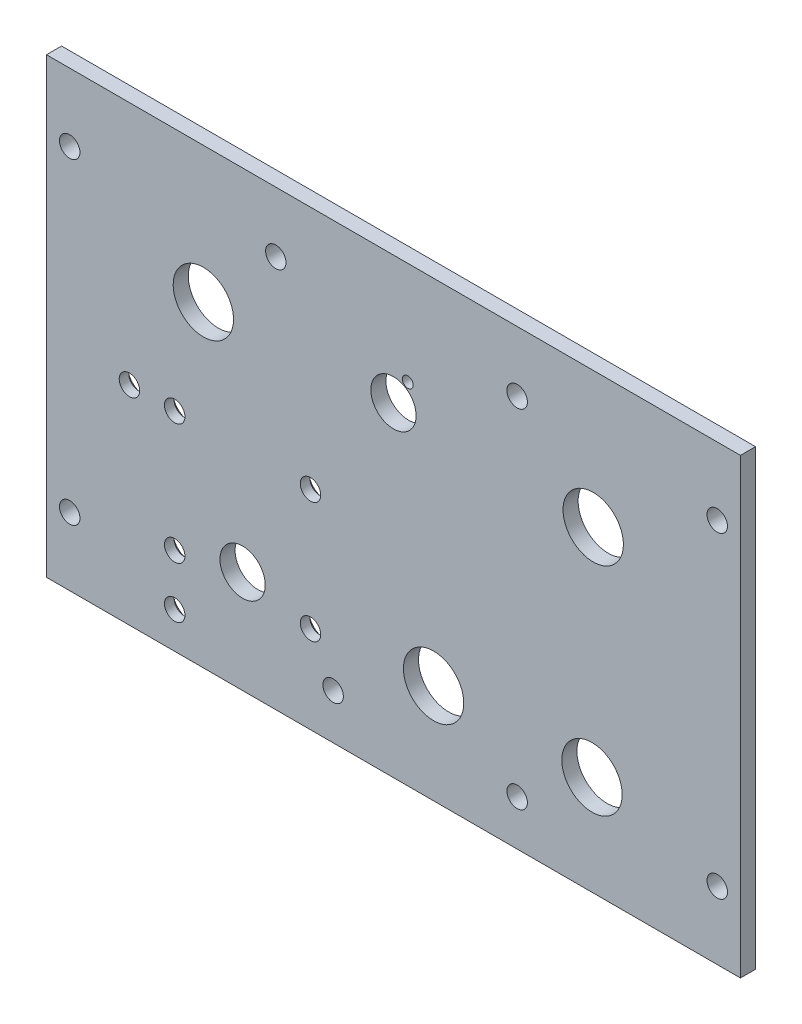
ISO-10303-21;
HEADER;
FILE_DESCRIPTION(('STEP AP214'),'2;1');
FILE_NAME('part.step','',(''),(''),'','','');
FILE_SCHEMA(('AUTOMOTIVE_DESIGN { 1 0 10303 214 1 1 1 1 }'));
ENDSEC;
DATA;
#1=APPLICATION_CONTEXT('core data for automotive mechanical design processes');
#2=APPLICATION_PROTOCOL_DEFINITION('international standard','automotive_design',2000,#1);
#3=PRODUCT_CONTEXT('',#1,'mechanical');
#4=PRODUCT('Part','Part','',(#3));
#5=PRODUCT_RELATED_PRODUCT_CATEGORY('part','',(#4));
#6=PRODUCT_DEFINITION_FORMATION('','',#4);
#7=PRODUCT_DEFINITION_CONTEXT('part definition',#1,'design');
#8=PRODUCT_DEFINITION('design','',#6,#7);
#9=PRODUCT_DEFINITION_SHAPE('','',#8);
#10=(LENGTH_UNIT() NAMED_UNIT(*) SI_UNIT(.MILLI.,.METRE.));
#11=(NAMED_UNIT(*) PLANE_ANGLE_UNIT() SI_UNIT($,.RADIAN.));
#12=(NAMED_UNIT(*) SI_UNIT($,.STERADIAN.) SOLID_ANGLE_UNIT());
#13=UNCERTAINTY_MEASURE_WITH_UNIT(LENGTH_MEASURE(1.E-05),#10,'distance_accuracy_value','');
#14=(GEOMETRIC_REPRESENTATION_CONTEXT(3) GLOBAL_UNCERTAINTY_ASSIGNED_CONTEXT((#13)) GLOBAL_UNIT_ASSIGNED_CONTEXT((#10,
#11,#12)) REPRESENTATION_CONTEXT('',''));
#15=CARTESIAN_POINT('',(0.,0.,0.));
#16=DIRECTION('',(0.,0.,1.));
#17=DIRECTION('',(1.,0.,0.));
#18=AXIS2_PLACEMENT_3D('',#15,#16,#17);
#19=CARTESIAN_POINT('',(0.,0.,-3.175));
#20=DIRECTION('',(0.,0.,1.));
#21=DIRECTION('',(1.,0.,0.));
#22=AXIS2_PLACEMENT_3D('',#19,#20,#21);
#23=PLANE('',#22);
#24=CARTESIAN_POINT('',(-70.0124018441509,73.6066419480666,-3.175));
#25=DIRECTION('',(0.,0.,1.));
#26=DIRECTION('',(1.,0.,0.));
#27=AXIS2_PLACEMENT_3D('',#24,#25,#26);
#28=CIRCLE('',#27,1.1344888753389);
#29=CARTESIAN_POINT('',(-68.877912968812,73.6066419480666,-3.175));
#30=VERTEX_POINT('',#29);
#31=EDGE_CURVE('E259',#30,#30,#28,.T.);
#32=ORIENTED_EDGE('',*,*,#31,.T.);
#33=EDGE_LOOP('',(#32));
#34=FACE_BOUND('',#33,.T.);
#35=CARTESIAN_POINT('',(-90.487500000001,43.8150000000016,-3.175));
#36=DIRECTION('',(0.,0.,-1.));
#37=DIRECTION('',(-1.,0.,0.));
#38=AXIS2_PLACEMENT_3D('',#35,#36,#37);
#39=CIRCLE('',#38,3.5433);
#40=CARTESIAN_POINT('',(-94.030800000001,43.8150000000016,-3.175));
#41=VERTEX_POINT('',#40);
#42=EDGE_CURVE('E266',#41,#41,#39,.T.);
#43=ORIENTED_EDGE('',*,*,#42,.F.);
#44=EDGE_LOOP('',(#43));
#45=FACE_BOUND('',#44,.T.);
#46=CARTESIAN_POINT('',(-90.487500000001,18.4150000000016,-3.175));
#47=DIRECTION('',(0.,0.,-1.));
#48=DIRECTION('',(-1.,0.,0.));
#49=AXIS2_PLACEMENT_3D('',#46,#47,#48);
#50=CIRCLE('',#49,3.5433);
#51=CARTESIAN_POINT('',(-94.030800000001,18.4150000000016,-3.175));
#52=VERTEX_POINT('',#51);
#53=EDGE_CURVE('E280',#52,#52,#50,.T.);
#54=ORIENTED_EDGE('',*,*,#53,.F.);
#55=EDGE_LOOP('',(#54));
#56=FACE_BOUND('',#55,.T.);
#57=CARTESIAN_POINT('',(-119.0625,7.63617204565672,-3.175));
#58=DIRECTION('',(0.,0.,-1.));
#59=DIRECTION('',(-1.,0.,0.));
#60=AXIS2_PLACEMENT_3D('',#57,#58,#59);
#61=CIRCLE('',#60,3.5433);
#62=CARTESIAN_POINT('',(-122.6058,7.63617204565672,-3.175));
#63=VERTEX_POINT('',#62);
#64=EDGE_CURVE('E292',#63,#63,#61,.T.);
#65=ORIENTED_EDGE('',*,*,#64,.F.);
#66=EDGE_LOOP('',(#65));
#67=FACE_BOUND('',#66,.T.);
#68=CARTESIAN_POINT('',(-119.062500000001,18.4150000000016,-3.175));
#69=DIRECTION('',(0.,0.,-1.));
#70=DIRECTION('',(-1.,0.,0.));
#71=AXIS2_PLACEMENT_3D('',#68,#69,#70);
#72=CIRCLE('',#71,3.5433);
#73=CARTESIAN_POINT('',(-122.605800000001,18.4150000000016,-3.175));
#74=VERTEX_POINT('',#73);
#75=EDGE_CURVE('E304',#74,#74,#72,.T.);
#76=ORIENTED_EDGE('',*,*,#75,.F.);
#77=EDGE_LOOP('',(#76));
#78=FACE_BOUND('',#77,.T.);
#79=CARTESIAN_POINT('',(-119.062500000001,43.8150000000016,-3.175));
#80=DIRECTION('',(0.,0.,-1.));
#81=DIRECTION('',(-1.,0.,0.));
#82=AXIS2_PLACEMENT_3D('',#79,#80,#81);
#83=CIRCLE('',#82,3.5433);
#84=CARTESIAN_POINT('',(-122.605800000001,43.8150000000016,-3.175));
#85=VERTEX_POINT('',#84);
#86=EDGE_CURVE('E316',#85,#85,#83,.T.);
#87=ORIENTED_EDGE('',*,*,#86,.F.);
#88=EDGE_LOOP('',(#87));
#89=FACE_BOUND('',#88,.T.);
#90=CARTESIAN_POINT('',(-104.775,21.5900000000007,-3.175));
#91=DIRECTION('',(0.,0.,1.));
#92=DIRECTION('',(1.,0.,0.));
#93=AXIS2_PLACEMENT_3D('',#90,#91,#92);
#94=CIRCLE('',#93,4.7625);
#95=CARTESIAN_POINT('',(-100.0125,21.5900000000007,-3.175));
#96=VERTEX_POINT('',#95);
#97=EDGE_CURVE('E344',#96,#96,#94,.T.);
#98=ORIENTED_EDGE('',*,*,#97,.T.);
#99=EDGE_LOOP('',(#98));
#100=FACE_BOUND('',#99,.T.);
#101=CARTESIAN_POINT('',(-73.0249999999999,68.3259999999999,-3.175));
#102=DIRECTION('',(0.,0.,1.));
#103=DIRECTION('',(1.,0.,0.));
#104=AXIS2_PLACEMENT_3D('',#101,#102,#103);
#105=CIRCLE('',#104,4.7625);
#106=CARTESIAN_POINT('',(-68.2624999999999,68.3259999999999,-3.175));
#107=VERTEX_POINT('',#106);
#108=EDGE_CURVE('E352',#107,#107,#105,.T.);
#109=ORIENTED_EDGE('',*,*,#108,.T.);
#110=EDGE_LOOP('',(#109));
#111=FACE_BOUND('',#110,.T.);
#112=CARTESIAN_POINT('',(-31.242,20.9550000000007,-3.175));
#113=DIRECTION('',(0.,0.,1.));
#114=DIRECTION('',(1.,0.,0.));
#115=AXIS2_PLACEMENT_3D('',#112,#113,#114);
#116=CIRCLE('',#115,6.35000000000001);
#117=CARTESIAN_POINT('',(-24.892,20.9550000000007,-3.175));
#118=VERTEX_POINT('',#117);
#119=EDGE_CURVE('E360',#118,#118,#116,.T.);
#120=ORIENTED_EDGE('',*,*,#119,.T.);
#121=EDGE_LOOP('',(#120));
#122=FACE_BOUND('',#121,.T.);
#123=CARTESIAN_POINT('',(-64.5795,20.955,-3.175));
#124=DIRECTION('',(0.,0.,1.));
#125=DIRECTION('',(1.,0.,0.));
#126=AXIS2_PLACEMENT_3D('',#123,#124,#125);
#127=CIRCLE('',#126,6.35000000000001);
#128=CARTESIAN_POINT('',(-58.2295,20.955,-3.175));
#129=VERTEX_POINT('',#128);
#130=EDGE_CURVE('E368',#129,#129,#127,.T.);
#131=ORIENTED_EDGE('',*,*,#130,.T.);
#132=EDGE_LOOP('',(#131));
#133=FACE_BOUND('',#132,.T.);
#134=CARTESIAN_POINT('',(-113.03,66.675,-3.175));
#135=DIRECTION('',(0.,0.,1.));
#136=DIRECTION('',(1.,0.,0.));
#137=AXIS2_PLACEMENT_3D('',#134,#135,#136);
#138=CIRCLE('',#137,6.35000000000001);
#139=CARTESIAN_POINT('',(-106.68,66.675,-3.175));
#140=VERTEX_POINT('',#139);
#141=EDGE_CURVE('E376',#140,#140,#138,.T.);
#142=ORIENTED_EDGE('',*,*,#141,.T.);
#143=EDGE_LOOP('',(#142));
#144=FACE_BOUND('',#143,.T.);
#145=CARTESIAN_POINT('',(-30.9879999999999,66.675,-3.175));
#146=DIRECTION('',(0.,0.,1.));
#147=DIRECTION('',(1.,0.,0.));
#148=AXIS2_PLACEMENT_3D('',#145,#146,#147);
#149=CIRCLE('',#148,6.35);
#150=CARTESIAN_POINT('',(-24.6379999999999,66.675,-3.175));
#151=VERTEX_POINT('',#150);
#152=EDGE_CURVE('E384',#151,#151,#149,.T.);
#153=ORIENTED_EDGE('',*,*,#152,.T.);
#154=EDGE_LOOP('',(#153));
#155=FACE_BOUND('',#154,.T.);
#156=CARTESIAN_POINT('',(-4.8895,80.9625,-3.175));
#157=DIRECTION('',(0.,0.,-1.));
#158=DIRECTION('',(-1.,0.,0.));
#159=AXIS2_PLACEMENT_3D('',#156,#157,#158);
#160=CIRCLE('',#159,2.15264999999999);
#161=CARTESIAN_POINT('',(-7.04214999999999,80.9625,-3.175));
#162=VERTEX_POINT('',#161);
#163=EDGE_CURVE('E388',#162,#162,#160,.T.);
#164=ORIENTED_EDGE('',*,*,#163,.F.);
#165=EDGE_LOOP('',(#164));
#166=FACE_BOUND('',#165,.T.);
#167=CARTESIAN_POINT('',(-141.1605,80.9625,-3.175));
#168=DIRECTION('',(0.,0.,-1.));
#169=DIRECTION('',(-1.,0.,0.));
#170=AXIS2_PLACEMENT_3D('',#167,#168,#169);
#171=CIRCLE('',#170,2.15264999999998);
#172=CARTESIAN_POINT('',(-143.31315,80.9625,-3.175));
#173=VERTEX_POINT('',#172);
#174=EDGE_CURVE('E396',#173,#173,#171,.T.);
#175=ORIENTED_EDGE('',*,*,#174,.F.);
#176=EDGE_LOOP('',(#175));
#177=FACE_BOUND('',#176,.T.);
#178=CARTESIAN_POINT('',(-141.1605,14.2875,-3.175));
#179=DIRECTION('',(0.,0.,-1.));
#180=DIRECTION('',(-1.,0.,0.));
#181=AXIS2_PLACEMENT_3D('',#178,#179,#180);
#182=CIRCLE('',#181,2.15264999999998);
#183=CARTESIAN_POINT('',(-143.31315,14.2875,-3.175));
#184=VERTEX_POINT('',#183);
#185=EDGE_CURVE('E404',#184,#184,#182,.T.);
#186=ORIENTED_EDGE('',*,*,#185,.F.);
#187=EDGE_LOOP('',(#186));
#188=FACE_BOUND('',#187,.T.);
#189=CARTESIAN_POINT('',(-4.88949999999997,14.2875,-3.175));
#190=DIRECTION('',(0.,0.,-1.));
#191=DIRECTION('',(-1.,0.,0.));
#192=AXIS2_PLACEMENT_3D('',#189,#190,#191);
#193=CIRCLE('',#192,2.15264999999999);
#194=CARTESIAN_POINT('',(-7.04214999999996,14.2875,-3.175));
#195=VERTEX_POINT('',#194);
#196=EDGE_CURVE('E412',#195,#195,#193,.T.);
#197=ORIENTED_EDGE('',*,*,#196,.F.);
#198=EDGE_LOOP('',(#197));
#199=FACE_BOUND('',#198,.T.);
#200=CARTESIAN_POINT('',(-46.99,9.525,-3.175));
#201=DIRECTION('',(0.,0.,-1.));
#202=DIRECTION('',(-1.,0.,0.));
#203=AXIS2_PLACEMENT_3D('',#200,#201,#202);
#204=CIRCLE('',#203,2.15264999999999);
#205=CARTESIAN_POINT('',(-49.14265,9.525,-3.175));
#206=VERTEX_POINT('',#205);
#207=EDGE_CURVE('E420',#206,#206,#204,.T.);
#208=ORIENTED_EDGE('',*,*,#207,.F.);
#209=EDGE_LOOP('',(#208));
#210=FACE_BOUND('',#209,.T.);
#211=CARTESIAN_POINT('',(-85.725,9.525,-3.175));
#212=DIRECTION('',(0.,0.,-1.));
#213=DIRECTION('',(-1.,0.,0.));
#214=AXIS2_PLACEMENT_3D('',#211,#212,#213);
#215=CIRCLE('',#214,2.15264999999999);
#216=CARTESIAN_POINT('',(-87.87765,9.525,-3.175));
#217=VERTEX_POINT('',#216);
#218=EDGE_CURVE('E428',#217,#217,#215,.T.);
#219=ORIENTED_EDGE('',*,*,#218,.F.);
#220=EDGE_LOOP('',(#219));
#221=FACE_BOUND('',#220,.T.);
#222=CARTESIAN_POINT('',(-97.79,82.55,-3.175));
#223=DIRECTION('',(0.,0.,-1.));
#224=DIRECTION('',(-1.,0.,0.));
#225=AXIS2_PLACEMENT_3D('',#222,#223,#224);
#226=CIRCLE('',#225,2.15264999999999);
#227=CARTESIAN_POINT('',(-99.94265,82.55,-3.175));
#228=VERTEX_POINT('',#227);
#229=EDGE_CURVE('E436',#228,#228,#226,.T.);
#230=ORIENTED_EDGE('',*,*,#229,.F.);
#231=EDGE_LOOP('',(#230));
#232=FACE_BOUND('',#231,.T.);
#233=CARTESIAN_POINT('',(-46.99,82.55,-3.175));
#234=DIRECTION('',(0.,0.,-1.));
#235=DIRECTION('',(-1.,0.,0.));
#236=AXIS2_PLACEMENT_3D('',#233,#234,#235);
#237=CIRCLE('',#236,2.15264999999999);
#238=CARTESIAN_POINT('',(-49.14265,82.55,-3.175));
#239=VERTEX_POINT('',#238);
#240=EDGE_CURVE('E444',#239,#239,#237,.T.);
#241=ORIENTED_EDGE('',*,*,#240,.F.);
#242=EDGE_LOOP('',(#241));
#243=FACE_BOUND('',#242,.T.);
#244=DIRECTION('',(0.,1.,0.));
#245=VECTOR('',#244,1.);
#246=CARTESIAN_POINT('',(0.,0.,-3.175));
#247=LINE('',#246,#245);
#248=CARTESIAN_POINT('',(0.,0.,-3.175));
#249=VERTEX_POINT('',#248);
#250=CARTESIAN_POINT('',(0.,95.25,-3.175));
#251=VERTEX_POINT('',#250);
#252=EDGE_CURVE('E102',#249,#251,#247,.T.);
#253=ORIENTED_EDGE('',*,*,#252,.F.);
#254=DIRECTION('',(1.,0.,0.));
#255=VECTOR('',#254,1.);
#256=CARTESIAN_POINT('',(-146.05,0.,-3.175));
#257=LINE('',#256,#255);
#258=CARTESIAN_POINT('',(-146.05,0.,-3.175));
#259=VERTEX_POINT('',#258);
#260=EDGE_CURVE('E97',#259,#249,#257,.T.);
#261=ORIENTED_EDGE('',*,*,#260,.F.);
#262=DIRECTION('',(0.,-1.,0.));
#263=VECTOR('',#262,1.);
#264=CARTESIAN_POINT('',(-146.05,95.25,-3.175));
#265=LINE('',#264,#263);
#266=CARTESIAN_POINT('',(-146.05,95.25,-3.175));
#267=VERTEX_POINT('',#266);
#268=EDGE_CURVE('E89',#267,#259,#265,.T.);
#269=ORIENTED_EDGE('',*,*,#268,.F.);
#270=DIRECTION('',(-1.,0.,0.));
#271=VECTOR('',#270,1.);
#272=CARTESIAN_POINT('',(0.,95.25,-3.175));
#273=LINE('',#272,#271);
#274=EDGE_CURVE('E96',#251,#267,#273,.T.);
#275=ORIENTED_EDGE('',*,*,#274,.F.);
#276=EDGE_LOOP('',(#253,#261,#269,#275));
#277=FACE_BOUND('',#276,.T.);
#278=CARTESIAN_POINT('',(-128.587500000001,43.8150000000016,-3.175));
#279=DIRECTION('',(0.,0.,-1.));
#280=DIRECTION('',(-1.,0.,0.));
#281=AXIS2_PLACEMENT_3D('',#278,#279,#280);
#282=CIRCLE('',#281,3.5433);
#283=CARTESIAN_POINT('',(-132.130800000001,43.8150000000016,-3.175));
#284=VERTEX_POINT('',#283);
#285=EDGE_CURVE('E328',#284,#284,#282,.T.);
#286=ORIENTED_EDGE('',*,*,#285,.F.);
#287=EDGE_LOOP('',(#286));
#288=FACE_BOUND('',#287,.T.);
#289=ADVANCED_FACE('F39',(#34,#45,#56,#67,#78,#89,#100,#111,#122,#133,#144,#155,#166,#177,#188,
#199,#210,#221,#232,#243,#277,#288),#23,.F.);
#290=CARTESIAN_POINT('',(0.,0.,0.));
#291=DIRECTION('',(0.,0.,1.));
#292=DIRECTION('',(1.,0.,0.));
#293=AXIS2_PLACEMENT_3D('',#290,#291,#292);
#294=PLANE('',#293);
#295=CARTESIAN_POINT('',(-70.0124018441509,73.6066419480666,0.));
#296=DIRECTION('',(0.,0.,1.));
#297=DIRECTION('',(1.,0.,0.));
#298=AXIS2_PLACEMENT_3D('',#295,#296,#297);
#299=CIRCLE('',#298,1.1344888753389);
#300=CARTESIAN_POINT('',(-68.877912968812,73.6066419480666,0.));
#301=VERTEX_POINT('',#300);
#302=EDGE_CURVE('E262',#301,#301,#299,.T.);
#303=ORIENTED_EDGE('',*,*,#302,.F.);
#304=EDGE_LOOP('',(#303));
#305=FACE_BOUND('',#304,.T.);
#306=CARTESIAN_POINT('',(-90.487500000001,43.8150000000016,0.));
#307=DIRECTION('',(0.,0.,-1.));
#308=DIRECTION('',(-1.,0.,0.));
#309=AXIS2_PLACEMENT_3D('',#306,#307,#308);
#310=CIRCLE('',#309,2.15264999999999);
#311=CARTESIAN_POINT('',(-92.640150000001,43.8150000000016,0.));
#312=VERTEX_POINT('',#311);
#313=EDGE_CURVE('E276',#312,#312,#310,.T.);
#314=ORIENTED_EDGE('',*,*,#313,.T.);
#315=EDGE_LOOP('',(#314));
#316=FACE_BOUND('',#315,.T.);
#317=CARTESIAN_POINT('',(-90.487500000001,18.4150000000016,0.));
#318=DIRECTION('',(0.,0.,-1.));
#319=DIRECTION('',(-1.,0.,0.));
#320=AXIS2_PLACEMENT_3D('',#317,#318,#319);
#321=CIRCLE('',#320,2.15264999999999);
#322=CARTESIAN_POINT('',(-92.640150000001,18.4150000000016,0.));
#323=VERTEX_POINT('',#322);
#324=EDGE_CURVE('E288',#323,#323,#321,.T.);
#325=ORIENTED_EDGE('',*,*,#324,.T.);
#326=EDGE_LOOP('',(#325));
#327=FACE_BOUND('',#326,.T.);
#328=CARTESIAN_POINT('',(-119.0625,7.63617204565672,0.));
#329=DIRECTION('',(0.,0.,-1.));
#330=DIRECTION('',(-1.,0.,0.));
#331=AXIS2_PLACEMENT_3D('',#328,#329,#330);
#332=CIRCLE('',#331,2.15264999999999);
#333=CARTESIAN_POINT('',(-121.21515,7.63617204565672,0.));
#334=VERTEX_POINT('',#333);
#335=EDGE_CURVE('E300',#334,#334,#332,.T.);
#336=ORIENTED_EDGE('',*,*,#335,.T.);
#337=EDGE_LOOP('',(#336));
#338=FACE_BOUND('',#337,.T.);
#339=CARTESIAN_POINT('',(-119.062500000001,18.4150000000016,0.));
#340=DIRECTION('',(0.,0.,-1.));
#341=DIRECTION('',(-1.,0.,0.));
#342=AXIS2_PLACEMENT_3D('',#339,#340,#341);
#343=CIRCLE('',#342,2.15264999999999);
#344=CARTESIAN_POINT('',(-121.215150000001,18.4150000000016,0.));
#345=VERTEX_POINT('',#344);
#346=EDGE_CURVE('E312',#345,#345,#343,.T.);
#347=ORIENTED_EDGE('',*,*,#346,.T.);
#348=EDGE_LOOP('',(#347));
#349=FACE_BOUND('',#348,.T.);
#350=CARTESIAN_POINT('',(-119.062500000001,43.8150000000016,0.));
#351=DIRECTION('',(0.,0.,-1.));
#352=DIRECTION('',(-1.,0.,0.));
#353=AXIS2_PLACEMENT_3D('',#350,#351,#352);
#354=CIRCLE('',#353,2.15264999999999);
#355=CARTESIAN_POINT('',(-121.215150000001,43.8150000000016,0.));
#356=VERTEX_POINT('',#355);
#357=EDGE_CURVE('E324',#356,#356,#354,.T.);
#358=ORIENTED_EDGE('',*,*,#357,.T.);
#359=EDGE_LOOP('',(#358));
#360=FACE_BOUND('',#359,.T.);
#361=DIRECTION('',(0.,1.,0.));
#362=VECTOR('',#361,1.);
#363=CARTESIAN_POINT('',(0.,0.,0.));
#364=LINE('',#363,#362);
#365=CARTESIAN_POINT('',(0.,0.,0.));
#366=VERTEX_POINT('',#365);
#367=CARTESIAN_POINT('',(0.,95.25,0.));
#368=VERTEX_POINT('',#367);
#369=EDGE_CURVE('E111',#366,#368,#364,.T.);
#370=ORIENTED_EDGE('',*,*,#369,.T.);
#371=DIRECTION('',(-1.,0.,0.));
#372=VECTOR('',#371,1.);
#373=CARTESIAN_POINT('',(0.,95.25,0.));
#374=LINE('',#373,#372);
#375=CARTESIAN_POINT('',(-146.05,95.25,0.));
#376=VERTEX_POINT('',#375);
#377=EDGE_CURVE('E115',#368,#376,#374,.T.);
#378=ORIENTED_EDGE('',*,*,#377,.T.);
#379=DIRECTION('',(0.,-1.,0.));
#380=VECTOR('',#379,1.);
#381=CARTESIAN_POINT('',(-146.05,95.25,0.));
#382=LINE('',#381,#380);
#383=CARTESIAN_POINT('',(-146.05,0.,0.));
#384=VERTEX_POINT('',#383);
#385=EDGE_CURVE('E91',#376,#384,#382,.T.);
#386=ORIENTED_EDGE('',*,*,#385,.T.);
#387=DIRECTION('',(1.,0.,0.));
#388=VECTOR('',#387,1.);
#389=CARTESIAN_POINT('',(-146.05,0.,0.));
#390=LINE('',#389,#388);
#391=EDGE_CURVE('E105',#384,#366,#390,.T.);
#392=ORIENTED_EDGE('',*,*,#391,.T.);
#393=EDGE_LOOP('',(#370,#378,#386,#392));
#394=FACE_BOUND('',#393,.T.);
#395=CARTESIAN_POINT('',(-46.99,82.55,0.));
#396=DIRECTION('',(0.,0.,-1.));
#397=DIRECTION('',(-1.,0.,0.));
#398=AXIS2_PLACEMENT_3D('',#395,#396,#397);
#399=CIRCLE('',#398,2.15265);
#400=CARTESIAN_POINT('',(-49.14265,82.55,0.));
#401=VERTEX_POINT('',#400);
#402=EDGE_CURVE('E116',#401,#401,#399,.T.);
#403=ORIENTED_EDGE('',*,*,#402,.T.);
#404=EDGE_LOOP('',(#403));
#405=FACE_BOUND('',#404,.T.);
#406=CARTESIAN_POINT('',(-97.79,82.55,0.));
#407=DIRECTION('',(0.,0.,-1.));
#408=DIRECTION('',(-1.,0.,0.));
#409=AXIS2_PLACEMENT_3D('',#406,#407,#408);
#410=CIRCLE('',#409,2.15264999999999);
#411=CARTESIAN_POINT('',(-99.94265,82.55,0.));
#412=VERTEX_POINT('',#411);
#413=EDGE_CURVE('E440',#412,#412,#410,.T.);
#414=ORIENTED_EDGE('',*,*,#413,.T.);
#415=EDGE_LOOP('',(#414));
#416=FACE_BOUND('',#415,.T.);
#417=CARTESIAN_POINT('',(-85.725,9.525,0.));
#418=DIRECTION('',(0.,0.,-1.));
#419=DIRECTION('',(-1.,0.,0.));
#420=AXIS2_PLACEMENT_3D('',#417,#418,#419);
#421=CIRCLE('',#420,2.15265000000001);
#422=CARTESIAN_POINT('',(-87.87765,9.525,0.));
#423=VERTEX_POINT('',#422);
#424=EDGE_CURVE('E432',#423,#423,#421,.T.);
#425=ORIENTED_EDGE('',*,*,#424,.T.);
#426=EDGE_LOOP('',(#425));
#427=FACE_BOUND('',#426,.T.);
#428=CARTESIAN_POINT('',(-46.99,9.525,0.));
#429=DIRECTION('',(0.,0.,-1.));
#430=DIRECTION('',(-1.,0.,0.));
#431=AXIS2_PLACEMENT_3D('',#428,#429,#430);
#432=CIRCLE('',#431,2.15265);
#433=CARTESIAN_POINT('',(-49.14265,9.525,0.));
#434=VERTEX_POINT('',#433);
#435=EDGE_CURVE('E424',#434,#434,#432,.T.);
#436=ORIENTED_EDGE('',*,*,#435,.T.);
#437=EDGE_LOOP('',(#436));
#438=FACE_BOUND('',#437,.T.);
#439=CARTESIAN_POINT('',(-4.88949999999997,14.2875,0.));
#440=DIRECTION('',(0.,0.,-1.));
#441=DIRECTION('',(-1.,0.,0.));
#442=AXIS2_PLACEMENT_3D('',#439,#440,#441);
#443=CIRCLE('',#442,2.15265);
#444=CARTESIAN_POINT('',(-7.04214999999997,14.2875,0.));
#445=VERTEX_POINT('',#444);
#446=EDGE_CURVE('E416',#445,#445,#443,.T.);
#447=ORIENTED_EDGE('',*,*,#446,.T.);
#448=EDGE_LOOP('',(#447));
#449=FACE_BOUND('',#448,.T.);
#450=CARTESIAN_POINT('',(-141.1605,14.2875,0.));
#451=DIRECTION('',(0.,0.,-1.));
#452=DIRECTION('',(-1.,0.,0.));
#453=AXIS2_PLACEMENT_3D('',#450,#451,#452);
#454=CIRCLE('',#453,2.15265000000001);
#455=CARTESIAN_POINT('',(-143.31315,14.2875,0.));
#456=VERTEX_POINT('',#455);
#457=EDGE_CURVE('E408',#456,#456,#454,.T.);
#458=ORIENTED_EDGE('',*,*,#457,.T.);
#459=EDGE_LOOP('',(#458));
#460=FACE_BOUND('',#459,.T.);
#461=CARTESIAN_POINT('',(-141.1605,80.9625,0.));
#462=DIRECTION('',(0.,0.,-1.));
#463=DIRECTION('',(-1.,0.,0.));
#464=AXIS2_PLACEMENT_3D('',#461,#462,#463);
#465=CIRCLE('',#464,2.15265000000001);
#466=CARTESIAN_POINT('',(-143.31315,80.9625,0.));
#467=VERTEX_POINT('',#466);
#468=EDGE_CURVE('E400',#467,#467,#465,.T.);
#469=ORIENTED_EDGE('',*,*,#468,.T.);
#470=EDGE_LOOP('',(#469));
#471=FACE_BOUND('',#470,.T.);
#472=CARTESIAN_POINT('',(-4.8895,80.9625,0.));
#473=DIRECTION('',(0.,0.,-1.));
#474=DIRECTION('',(-1.,0.,0.));
#475=AXIS2_PLACEMENT_3D('',#472,#473,#474);
#476=CIRCLE('',#475,2.15265);
#477=CARTESIAN_POINT('',(-7.04215,80.9625,0.));
#478=VERTEX_POINT('',#477);
#479=EDGE_CURVE('E392',#478,#478,#476,.T.);
#480=ORIENTED_EDGE('',*,*,#479,.T.);
#481=EDGE_LOOP('',(#480));
#482=FACE_BOUND('',#481,.T.);
#483=CARTESIAN_POINT('',(-30.9879999999999,66.675,0.));
#484=DIRECTION('',(0.,0.,-1.));
#485=DIRECTION('',(0.,1.,0.));
#486=AXIS2_PLACEMENT_3D('',#483,#484,#485);
#487=CIRCLE('',#486,6.35);
#488=CARTESIAN_POINT('',(-30.9879999999999,73.025,0.));
#489=VERTEX_POINT('',#488);
#490=EDGE_CURVE('E380',#489,#489,#487,.T.);
#491=ORIENTED_EDGE('',*,*,#490,.T.);
#492=EDGE_LOOP('',(#491));
#493=FACE_BOUND('',#492,.T.);
#494=CARTESIAN_POINT('',(-113.03,66.675,0.));
#495=DIRECTION('',(0.,0.,-1.));
#496=DIRECTION('',(0.,1.,0.));
#497=AXIS2_PLACEMENT_3D('',#494,#495,#496);
#498=CIRCLE('',#497,6.35000000000001);
#499=CARTESIAN_POINT('',(-113.03,73.025,0.));
#500=VERTEX_POINT('',#499);
#501=EDGE_CURVE('E372',#500,#500,#498,.T.);
#502=ORIENTED_EDGE('',*,*,#501,.T.);
#503=EDGE_LOOP('',(#502));
#504=FACE_BOUND('',#503,.T.);
#505=CARTESIAN_POINT('',(-64.5795,20.955,0.));
#506=DIRECTION('',(0.,0.,-1.));
#507=DIRECTION('',(0.,1.,0.));
#508=AXIS2_PLACEMENT_3D('',#505,#506,#507);
#509=CIRCLE('',#508,6.35000000000001);
#510=CARTESIAN_POINT('',(-64.5795,27.305,0.));
#511=VERTEX_POINT('',#510);
#512=EDGE_CURVE('E364',#511,#511,#509,.T.);
#513=ORIENTED_EDGE('',*,*,#512,.T.);
#514=EDGE_LOOP('',(#513));
#515=FACE_BOUND('',#514,.T.);
#516=CARTESIAN_POINT('',(-31.242,20.9550000000007,0.));
#517=DIRECTION('',(0.,0.,-1.));
#518=DIRECTION('',(0.,1.,0.));
#519=AXIS2_PLACEMENT_3D('',#516,#517,#518);
#520=CIRCLE('',#519,6.35000000000001);
#521=CARTESIAN_POINT('',(-31.242,27.3050000000007,0.));
#522=VERTEX_POINT('',#521);
#523=EDGE_CURVE('E356',#522,#522,#520,.T.);
#524=ORIENTED_EDGE('',*,*,#523,.T.);
#525=EDGE_LOOP('',(#524));
#526=FACE_BOUND('',#525,.T.);
#527=CARTESIAN_POINT('',(-73.0249999999999,68.3259999999999,0.));
#528=DIRECTION('',(0.,0.,-1.));
#529=DIRECTION('',(0.,1.,0.));
#530=AXIS2_PLACEMENT_3D('',#527,#528,#529);
#531=CIRCLE('',#530,4.7625);
#532=CARTESIAN_POINT('',(-73.0249999999999,73.0884999999999,0.));
#533=VERTEX_POINT('',#532);
#534=EDGE_CURVE('E348',#533,#533,#531,.T.);
#535=ORIENTED_EDGE('',*,*,#534,.T.);
#536=EDGE_LOOP('',(#535));
#537=FACE_BOUND('',#536,.T.);
#538=CARTESIAN_POINT('',(-104.775,21.5900000000007,0.));
#539=DIRECTION('',(0.,0.,-1.));
#540=DIRECTION('',(0.,1.,0.));
#541=AXIS2_PLACEMENT_3D('',#538,#539,#540);
#542=CIRCLE('',#541,4.7625);
#543=CARTESIAN_POINT('',(-104.775,26.3525000000007,0.));
#544=VERTEX_POINT('',#543);
#545=EDGE_CURVE('E340',#544,#544,#542,.T.);
#546=ORIENTED_EDGE('',*,*,#545,.T.);
#547=EDGE_LOOP('',(#546));
#548=FACE_BOUND('',#547,.T.);
#549=CARTESIAN_POINT('',(-128.587500000001,43.8150000000016,0.));
#550=DIRECTION('',(0.,0.,-1.));
#551=DIRECTION('',(-1.,0.,0.));
#552=AXIS2_PLACEMENT_3D('',#549,#550,#551);
#553=CIRCLE('',#552,2.15265000000001);
#554=CARTESIAN_POINT('',(-130.740150000001,43.8150000000016,0.));
#555=VERTEX_POINT('',#554);
#556=EDGE_CURVE('E336',#555,#555,#553,.T.);
#557=ORIENTED_EDGE('',*,*,#556,.T.);
#558=EDGE_LOOP('',(#557));
#559=FACE_BOUND('',#558,.T.);
#560=ADVANCED_FACE('F127',(#305,#316,#327,#338,#349,#360,#394,#405,#416,#427,#438,#449,#460,
#471,#482,#493,#504,#515,#526,#537,#548,#559),#294,.T.);
#561=CARTESIAN_POINT('',(0.,0.,-3.175));
#562=DIRECTION('',(1.,0.,0.));
#563=DIRECTION('',(0.,1.,0.));
#564=AXIS2_PLACEMENT_3D('',#561,#562,#563);
#565=PLANE('',#564);
#566=ORIENTED_EDGE('',*,*,#369,.F.);
#567=DIRECTION('',(0.,0.,1.));
#568=VECTOR('',#567,1.);
#569=CARTESIAN_POINT('',(0.,0.,-3.175));
#570=LINE('',#569,#568);
#571=EDGE_CURVE('E11',#249,#366,#570,.T.);
#572=ORIENTED_EDGE('',*,*,#571,.F.);
#573=ORIENTED_EDGE('',*,*,#252,.T.);
#574=DIRECTION('',(0.,0.,1.));
#575=VECTOR('',#574,1.);
#576=CARTESIAN_POINT('',(0.,95.25,-3.175));
#577=LINE('',#576,#575);
#578=EDGE_CURVE('E43',#251,#368,#577,.T.);
#579=ORIENTED_EDGE('',*,*,#578,.T.);
#580=EDGE_LOOP('',(#566,#572,#573,#579));
#581=FACE_BOUND('',#580,.T.);
#582=ADVANCED_FACE('F41',(#581),#565,.T.);
#583=CARTESIAN_POINT('',(-146.05,0.,-3.175));
#584=DIRECTION('',(0.,-1.,0.));
#585=DIRECTION('',(1.,0.,0.));
#586=AXIS2_PLACEMENT_3D('',#583,#584,#585);
#587=PLANE('',#586);
#588=ORIENTED_EDGE('',*,*,#391,.F.);
#589=DIRECTION('',(0.,0.,1.));
#590=VECTOR('',#589,1.);
#591=CARTESIAN_POINT('',(-146.05,0.,-3.175));
#592=LINE('',#591,#590);
#593=EDGE_CURVE('E50',#259,#384,#592,.T.);
#594=ORIENTED_EDGE('',*,*,#593,.F.);
#595=ORIENTED_EDGE('',*,*,#260,.T.);
#596=ORIENTED_EDGE('',*,*,#571,.T.);
#597=EDGE_LOOP('',(#588,#594,#595,#596));
#598=FACE_BOUND('',#597,.T.);
#599=ADVANCED_FACE('F129',(#598),#587,.T.);
#600=CARTESIAN_POINT('',(-146.05,95.25,-3.175));
#601=DIRECTION('',(-1.,0.,0.));
#602=DIRECTION('',(0.,0.,1.));
#603=AXIS2_PLACEMENT_3D('',#600,#601,#602);
#604=PLANE('',#603);
#605=ORIENTED_EDGE('',*,*,#385,.F.);
#606=DIRECTION('',(0.,0.,1.));
#607=VECTOR('',#606,1.);
#608=CARTESIAN_POINT('',(-146.05,95.25,-3.175));
#609=LINE('',#608,#607);
#610=EDGE_CURVE('E86',#267,#376,#609,.T.);
#611=ORIENTED_EDGE('',*,*,#610,.F.);
#612=ORIENTED_EDGE('',*,*,#268,.T.);
#613=ORIENTED_EDGE('',*,*,#593,.T.);
#614=EDGE_LOOP('',(#605,#611,#612,#613));
#615=FACE_BOUND('',#614,.T.);
#616=ADVANCED_FACE('F88',(#615),#604,.T.);
#617=CARTESIAN_POINT('',(0.,95.25,-3.175));
#618=DIRECTION('',(0.,1.,0.));
#619=DIRECTION('',(0.,0.,1.));
#620=AXIS2_PLACEMENT_3D('',#617,#618,#619);
#621=PLANE('',#620);
#622=ORIENTED_EDGE('',*,*,#377,.F.);
#623=ORIENTED_EDGE('',*,*,#578,.F.);
#624=ORIENTED_EDGE('',*,*,#274,.T.);
#625=ORIENTED_EDGE('',*,*,#610,.T.);
#626=EDGE_LOOP('',(#622,#623,#624,#625));
#627=FACE_BOUND('',#626,.T.);
#628=ADVANCED_FACE('F100',(#627),#621,.T.);
#629=CARTESIAN_POINT('',(-46.99,82.55,-3.175));
#630=DIRECTION('',(0.,0.,-1.));
#631=DIRECTION('',(-1.,0.,0.));
#632=AXIS2_PLACEMENT_3D('',#629,#630,#631);
#633=CYLINDRICAL_SURFACE('',#632,2.15264999999999);
#634=ORIENTED_EDGE('',*,*,#402,.F.);
#635=EDGE_LOOP('',(#634));
#636=FACE_BOUND('',#635,.T.);
#637=ORIENTED_EDGE('',*,*,#240,.T.);
#638=EDGE_LOOP('',(#637));
#639=FACE_BOUND('',#638,.T.);
#640=ADVANCED_FACE('F148',(#636,#639),#633,.F.);
#641=CARTESIAN_POINT('',(-97.79,82.55,-3.175));
#642=DIRECTION('',(0.,0.,-1.));
#643=DIRECTION('',(-1.,0.,0.));
#644=AXIS2_PLACEMENT_3D('',#641,#642,#643);
#645=CYLINDRICAL_SURFACE('',#644,2.15264999999999);
#646=ORIENTED_EDGE('',*,*,#413,.F.);
#647=EDGE_LOOP('',(#646));
#648=FACE_BOUND('',#647,.T.);
#649=ORIENTED_EDGE('',*,*,#229,.T.);
#650=EDGE_LOOP('',(#649));
#651=FACE_BOUND('',#650,.T.);
#652=ADVANCED_FACE('F151',(#648,#651),#645,.F.);
#653=CARTESIAN_POINT('',(-85.725,9.525,-3.175));
#654=DIRECTION('',(0.,0.,-1.));
#655=DIRECTION('',(-1.,0.,0.));
#656=AXIS2_PLACEMENT_3D('',#653,#654,#655);
#657=CYLINDRICAL_SURFACE('',#656,2.15265);
#658=ORIENTED_EDGE('',*,*,#424,.F.);
#659=EDGE_LOOP('',(#658));
#660=FACE_BOUND('',#659,.T.);
#661=ORIENTED_EDGE('',*,*,#218,.T.);
#662=EDGE_LOOP('',(#661));
#663=FACE_BOUND('',#662,.T.);
#664=ADVANCED_FACE('F155',(#660,#663),#657,.F.);
#665=CARTESIAN_POINT('',(-46.99,9.525,-3.175));
#666=DIRECTION('',(0.,0.,-1.));
#667=DIRECTION('',(-1.,0.,0.));
#668=AXIS2_PLACEMENT_3D('',#665,#666,#667);
#669=CYLINDRICAL_SURFACE('',#668,2.15264999999999);
#670=ORIENTED_EDGE('',*,*,#435,.F.);
#671=EDGE_LOOP('',(#670));
#672=FACE_BOUND('',#671,.T.);
#673=ORIENTED_EDGE('',*,*,#207,.T.);
#674=EDGE_LOOP('',(#673));
#675=FACE_BOUND('',#674,.T.);
#676=ADVANCED_FACE('F159',(#672,#675),#669,.F.);
#677=CARTESIAN_POINT('',(-4.88949999999997,14.2875,-3.175));
#678=DIRECTION('',(0.,0.,-1.));
#679=DIRECTION('',(-1.,0.,0.));
#680=AXIS2_PLACEMENT_3D('',#677,#678,#679);
#681=CYLINDRICAL_SURFACE('',#680,2.15264999999999);
#682=ORIENTED_EDGE('',*,*,#446,.F.);
#683=EDGE_LOOP('',(#682));
#684=FACE_BOUND('',#683,.T.);
#685=ORIENTED_EDGE('',*,*,#196,.T.);
#686=EDGE_LOOP('',(#685));
#687=FACE_BOUND('',#686,.T.);
#688=ADVANCED_FACE('F163',(#684,#687),#681,.F.);
#689=CARTESIAN_POINT('',(-141.1605,14.2875,-3.175));
#690=DIRECTION('',(0.,0.,-1.));
#691=DIRECTION('',(-1.,0.,0.));
#692=AXIS2_PLACEMENT_3D('',#689,#690,#691);
#693=CYLINDRICAL_SURFACE('',#692,2.15264999999999);
#694=ORIENTED_EDGE('',*,*,#457,.F.);
#695=EDGE_LOOP('',(#694));
#696=FACE_BOUND('',#695,.T.);
#697=ORIENTED_EDGE('',*,*,#185,.T.);
#698=EDGE_LOOP('',(#697));
#699=FACE_BOUND('',#698,.T.);
#700=ADVANCED_FACE('F167',(#696,#699),#693,.F.);
#701=CARTESIAN_POINT('',(-141.1605,80.9625,-3.175));
#702=DIRECTION('',(0.,0.,-1.));
#703=DIRECTION('',(-1.,0.,0.));
#704=AXIS2_PLACEMENT_3D('',#701,#702,#703);
#705=CYLINDRICAL_SURFACE('',#704,2.15264999999999);
#706=ORIENTED_EDGE('',*,*,#468,.F.);
#707=EDGE_LOOP('',(#706));
#708=FACE_BOUND('',#707,.T.);
#709=ORIENTED_EDGE('',*,*,#174,.T.);
#710=EDGE_LOOP('',(#709));
#711=FACE_BOUND('',#710,.T.);
#712=ADVANCED_FACE('F171',(#708,#711),#705,.F.);
#713=CARTESIAN_POINT('',(-4.8895,80.9625,-3.175));
#714=DIRECTION('',(0.,0.,-1.));
#715=DIRECTION('',(-1.,0.,0.));
#716=AXIS2_PLACEMENT_3D('',#713,#714,#715);
#717=CYLINDRICAL_SURFACE('',#716,2.15264999999999);
#718=ORIENTED_EDGE('',*,*,#479,.F.);
#719=EDGE_LOOP('',(#718));
#720=FACE_BOUND('',#719,.T.);
#721=ORIENTED_EDGE('',*,*,#163,.T.);
#722=EDGE_LOOP('',(#721));
#723=FACE_BOUND('',#722,.T.);
#724=ADVANCED_FACE('F175',(#720,#723),#717,.F.);
#725=CARTESIAN_POINT('',(-30.9879999999999,66.675,0.));
#726=DIRECTION('',(0.,0.,-1.));
#727=DIRECTION('',(0.,1.,0.));
#728=AXIS2_PLACEMENT_3D('',#725,#726,#727);
#729=CYLINDRICAL_SURFACE('',#728,6.35);
#730=ORIENTED_EDGE('',*,*,#490,.F.);
#731=EDGE_LOOP('',(#730));
#732=FACE_BOUND('',#731,.T.);
#733=ORIENTED_EDGE('',*,*,#152,.F.);
#734=EDGE_LOOP('',(#733));
#735=FACE_BOUND('',#734,.T.);
#736=ADVANCED_FACE('F179',(#732,#735),#729,.F.);
#737=CARTESIAN_POINT('',(-113.03,66.675,0.));
#738=DIRECTION('',(0.,0.,-1.));
#739=DIRECTION('',(0.,1.,0.));
#740=AXIS2_PLACEMENT_3D('',#737,#738,#739);
#741=CYLINDRICAL_SURFACE('',#740,6.35000000000001);
#742=ORIENTED_EDGE('',*,*,#501,.F.);
#743=EDGE_LOOP('',(#742));
#744=FACE_BOUND('',#743,.T.);
#745=ORIENTED_EDGE('',*,*,#141,.F.);
#746=EDGE_LOOP('',(#745));
#747=FACE_BOUND('',#746,.T.);
#748=ADVANCED_FACE('F183',(#744,#747),#741,.F.);
#749=CARTESIAN_POINT('',(-64.5795,20.955,0.));
#750=DIRECTION('',(0.,0.,-1.));
#751=DIRECTION('',(0.,1.,0.));
#752=AXIS2_PLACEMENT_3D('',#749,#750,#751);
#753=CYLINDRICAL_SURFACE('',#752,6.35000000000001);
#754=ORIENTED_EDGE('',*,*,#512,.F.);
#755=EDGE_LOOP('',(#754));
#756=FACE_BOUND('',#755,.T.);
#757=ORIENTED_EDGE('',*,*,#130,.F.);
#758=EDGE_LOOP('',(#757));
#759=FACE_BOUND('',#758,.T.);
#760=ADVANCED_FACE('F187',(#756,#759),#753,.F.);
#761=CARTESIAN_POINT('',(-31.242,20.9550000000007,0.));
#762=DIRECTION('',(0.,0.,-1.));
#763=DIRECTION('',(0.,1.,0.));
#764=AXIS2_PLACEMENT_3D('',#761,#762,#763);
#765=CYLINDRICAL_SURFACE('',#764,6.35000000000001);
#766=ORIENTED_EDGE('',*,*,#523,.F.);
#767=EDGE_LOOP('',(#766));
#768=FACE_BOUND('',#767,.T.);
#769=ORIENTED_EDGE('',*,*,#119,.F.);
#770=EDGE_LOOP('',(#769));
#771=FACE_BOUND('',#770,.T.);
#772=ADVANCED_FACE('F191',(#768,#771),#765,.F.);
#773=CARTESIAN_POINT('',(-73.0249999999999,68.3259999999999,0.));
#774=DIRECTION('',(0.,0.,-1.));
#775=DIRECTION('',(0.,1.,0.));
#776=AXIS2_PLACEMENT_3D('',#773,#774,#775);
#777=CYLINDRICAL_SURFACE('',#776,4.7625);
#778=ORIENTED_EDGE('',*,*,#534,.F.);
#779=EDGE_LOOP('',(#778));
#780=FACE_BOUND('',#779,.T.);
#781=ORIENTED_EDGE('',*,*,#108,.F.);
#782=EDGE_LOOP('',(#781));
#783=FACE_BOUND('',#782,.T.);
#784=ADVANCED_FACE('F195',(#780,#783),#777,.F.);
#785=CARTESIAN_POINT('',(-104.775,21.5900000000007,0.));
#786=DIRECTION('',(0.,0.,-1.));
#787=DIRECTION('',(0.,1.,0.));
#788=AXIS2_PLACEMENT_3D('',#785,#786,#787);
#789=CYLINDRICAL_SURFACE('',#788,4.7625);
#790=ORIENTED_EDGE('',*,*,#545,.F.);
#791=EDGE_LOOP('',(#790));
#792=FACE_BOUND('',#791,.T.);
#793=ORIENTED_EDGE('',*,*,#97,.F.);
#794=EDGE_LOOP('',(#793));
#795=FACE_BOUND('',#794,.T.);
#796=ADVANCED_FACE('F199',(#792,#795),#789,.F.);
#797=CARTESIAN_POINT('',(-128.587500000001,43.8150000000016,-3.175));
#798=DIRECTION('',(0.,0.,-1.));
#799=DIRECTION('',(-1.,0.,0.));
#800=AXIS2_PLACEMENT_3D('',#797,#798,#799);
#801=CYLINDRICAL_SURFACE('',#800,2.15265000000001);
#802=ORIENTED_EDGE('',*,*,#556,.F.);
#803=EDGE_LOOP('',(#802));
#804=FACE_BOUND('',#803,.T.);
#805=CARTESIAN_POINT('',(-128.587500000001,43.8150000000016,-2.00810609790331));
#806=DIRECTION('',(0.,0.,-1.));
#807=DIRECTION('',(-1.,0.,0.));
#808=AXIS2_PLACEMENT_3D('',#805,#806,#807);
#809=CIRCLE('',#808,2.15265000000001);
#810=CARTESIAN_POINT('',(-130.740150000001,43.8150000000016,-2.00810609790331));
#811=VERTEX_POINT('',#810);
#812=EDGE_CURVE('E332',#811,#811,#809,.T.);
#813=ORIENTED_EDGE('',*,*,#812,.T.);
#814=EDGE_LOOP('',(#813));
#815=FACE_BOUND('',#814,.T.);
#816=ADVANCED_FACE('F203',(#804,#815),#801,.F.);
#817=CARTESIAN_POINT('',(-128.587500000001,43.8150000000016,-3.175));
#818=DIRECTION('',(0.,0.,-1.));
#819=DIRECTION('',(-1.,0.,0.));
#820=AXIS2_PLACEMENT_3D('',#817,#818,#819);
#821=CONICAL_SURFACE('',#820,3.5433,0.872664625997161);
#822=ORIENTED_EDGE('',*,*,#812,.F.);
#823=EDGE_LOOP('',(#822));
#824=FACE_BOUND('',#823,.T.);
#825=ORIENTED_EDGE('',*,*,#285,.T.);
#826=EDGE_LOOP('',(#825));
#827=FACE_BOUND('',#826,.T.);
#828=ADVANCED_FACE('F207',(#824,#827),#821,.F.);
#829=CARTESIAN_POINT('',(-119.062500000001,43.8150000000016,-3.175));
#830=DIRECTION('',(0.,0.,-1.));
#831=DIRECTION('',(-1.,0.,0.));
#832=AXIS2_PLACEMENT_3D('',#829,#830,#831);
#833=CYLINDRICAL_SURFACE('',#832,2.15264999999999);
#834=ORIENTED_EDGE('',*,*,#357,.F.);
#835=EDGE_LOOP('',(#834));
#836=FACE_BOUND('',#835,.T.);
#837=CARTESIAN_POINT('',(-119.062500000001,43.8150000000016,-2.00810609790331));
#838=DIRECTION('',(0.,0.,-1.));
#839=DIRECTION('',(-1.,0.,0.));
#840=AXIS2_PLACEMENT_3D('',#837,#838,#839);
#841=CIRCLE('',#840,2.15264999999999);
#842=CARTESIAN_POINT('',(-121.215150000001,43.8150000000016,-2.00810609790331));
#843=VERTEX_POINT('',#842);
#844=EDGE_CURVE('E320',#843,#843,#841,.T.);
#845=ORIENTED_EDGE('',*,*,#844,.T.);
#846=EDGE_LOOP('',(#845));
#847=FACE_BOUND('',#846,.T.);
#848=ADVANCED_FACE('F211',(#836,#847),#833,.F.);
#849=CARTESIAN_POINT('',(-119.062500000001,43.8150000000016,-3.175));
#850=DIRECTION('',(0.,0.,-1.));
#851=DIRECTION('',(-1.,0.,0.));
#852=AXIS2_PLACEMENT_3D('',#849,#850,#851);
#853=CONICAL_SURFACE('',#852,3.5433,0.872664625997166);
#854=ORIENTED_EDGE('',*,*,#844,.F.);
#855=EDGE_LOOP('',(#854));
#856=FACE_BOUND('',#855,.T.);
#857=ORIENTED_EDGE('',*,*,#86,.T.);
#858=EDGE_LOOP('',(#857));
#859=FACE_BOUND('',#858,.T.);
#860=ADVANCED_FACE('F215',(#856,#859),#853,.F.);
#861=CARTESIAN_POINT('',(-119.062500000001,18.4150000000016,-3.175));
#862=DIRECTION('',(0.,0.,-1.));
#863=DIRECTION('',(-1.,0.,0.));
#864=AXIS2_PLACEMENT_3D('',#861,#862,#863);
#865=CYLINDRICAL_SURFACE('',#864,2.15264999999999);
#866=ORIENTED_EDGE('',*,*,#346,.F.);
#867=EDGE_LOOP('',(#866));
#868=FACE_BOUND('',#867,.T.);
#869=CARTESIAN_POINT('',(-119.062500000001,18.4150000000016,-2.00810609790331));
#870=DIRECTION('',(0.,0.,-1.));
#871=DIRECTION('',(-1.,0.,0.));
#872=AXIS2_PLACEMENT_3D('',#869,#870,#871);
#873=CIRCLE('',#872,2.15264999999999);
#874=CARTESIAN_POINT('',(-121.215150000001,18.4150000000016,-2.00810609790331));
#875=VERTEX_POINT('',#874);
#876=EDGE_CURVE('E308',#875,#875,#873,.T.);
#877=ORIENTED_EDGE('',*,*,#876,.T.);
#878=EDGE_LOOP('',(#877));
#879=FACE_BOUND('',#878,.T.);
#880=ADVANCED_FACE('F219',(#868,#879),#865,.F.);
#881=CARTESIAN_POINT('',(-119.062500000001,18.4150000000016,-3.175));
#882=DIRECTION('',(0.,0.,-1.));
#883=DIRECTION('',(-1.,0.,0.));
#884=AXIS2_PLACEMENT_3D('',#881,#882,#883);
#885=CONICAL_SURFACE('',#884,3.5433,0.872664625997166);
#886=ORIENTED_EDGE('',*,*,#876,.F.);
#887=EDGE_LOOP('',(#886));
#888=FACE_BOUND('',#887,.T.);
#889=ORIENTED_EDGE('',*,*,#75,.T.);
#890=EDGE_LOOP('',(#889));
#891=FACE_BOUND('',#890,.T.);
#892=ADVANCED_FACE('F223',(#888,#891),#885,.F.);
#893=CARTESIAN_POINT('',(-119.0625,7.63617204565672,-3.175));
#894=DIRECTION('',(0.,0.,-1.));
#895=DIRECTION('',(-1.,0.,0.));
#896=AXIS2_PLACEMENT_3D('',#893,#894,#895);
#897=CYLINDRICAL_SURFACE('',#896,2.15264999999999);
#898=ORIENTED_EDGE('',*,*,#335,.F.);
#899=EDGE_LOOP('',(#898));
#900=FACE_BOUND('',#899,.T.);
#901=CARTESIAN_POINT('',(-119.0625,7.63617204565672,-2.00810609790331));
#902=DIRECTION('',(0.,0.,-1.));
#903=DIRECTION('',(-1.,0.,0.));
#904=AXIS2_PLACEMENT_3D('',#901,#902,#903);
#905=CIRCLE('',#904,2.15264999999999);
#906=CARTESIAN_POINT('',(-121.21515,7.63617204565672,-2.00810609790331));
#907=VERTEX_POINT('',#906);
#908=EDGE_CURVE('E296',#907,#907,#905,.T.);
#909=ORIENTED_EDGE('',*,*,#908,.T.);
#910=EDGE_LOOP('',(#909));
#911=FACE_BOUND('',#910,.T.);
#912=ADVANCED_FACE('F227',(#900,#911),#897,.F.);
#913=CARTESIAN_POINT('',(-119.0625,7.63617204565672,-3.175));
#914=DIRECTION('',(0.,0.,-1.));
#915=DIRECTION('',(-1.,0.,0.));
#916=AXIS2_PLACEMENT_3D('',#913,#914,#915);
#917=CONICAL_SURFACE('',#916,3.5433,0.872664625997166);
#918=ORIENTED_EDGE('',*,*,#908,.F.);
#919=EDGE_LOOP('',(#918));
#920=FACE_BOUND('',#919,.T.);
#921=ORIENTED_EDGE('',*,*,#64,.T.);
#922=EDGE_LOOP('',(#921));
#923=FACE_BOUND('',#922,.T.);
#924=ADVANCED_FACE('F231',(#920,#923),#917,.F.);
#925=CARTESIAN_POINT('',(-90.487500000001,18.4150000000016,-3.175));
#926=DIRECTION('',(0.,0.,-1.));
#927=DIRECTION('',(-1.,0.,0.));
#928=AXIS2_PLACEMENT_3D('',#925,#926,#927);
#929=CYLINDRICAL_SURFACE('',#928,2.15264999999999);
#930=ORIENTED_EDGE('',*,*,#324,.F.);
#931=EDGE_LOOP('',(#930));
#932=FACE_BOUND('',#931,.T.);
#933=CARTESIAN_POINT('',(-90.487500000001,18.4150000000016,-2.00810609790331));
#934=DIRECTION('',(0.,0.,-1.));
#935=DIRECTION('',(-1.,0.,0.));
#936=AXIS2_PLACEMENT_3D('',#933,#934,#935);
#937=CIRCLE('',#936,2.15264999999999);
#938=CARTESIAN_POINT('',(-92.640150000001,18.4150000000016,-2.00810609790331));
#939=VERTEX_POINT('',#938);
#940=EDGE_CURVE('E284',#939,#939,#937,.T.);
#941=ORIENTED_EDGE('',*,*,#940,.T.);
#942=EDGE_LOOP('',(#941));
#943=FACE_BOUND('',#942,.T.);
#944=ADVANCED_FACE('F235',(#932,#943),#929,.F.);
#945=CARTESIAN_POINT('',(-90.487500000001,18.4150000000016,-3.175));
#946=DIRECTION('',(0.,0.,-1.));
#947=DIRECTION('',(-1.,0.,0.));
#948=AXIS2_PLACEMENT_3D('',#945,#946,#947);
#949=CONICAL_SURFACE('',#948,3.5433,0.872664625997166);
#950=ORIENTED_EDGE('',*,*,#940,.F.);
#951=EDGE_LOOP('',(#950));
#952=FACE_BOUND('',#951,.T.);
#953=ORIENTED_EDGE('',*,*,#53,.T.);
#954=EDGE_LOOP('',(#953));
#955=FACE_BOUND('',#954,.T.);
#956=ADVANCED_FACE('F239',(#952,#955),#949,.F.);
#957=CARTESIAN_POINT('',(-90.487500000001,43.8150000000016,-3.175));
#958=DIRECTION('',(0.,0.,-1.));
#959=DIRECTION('',(-1.,0.,0.));
#960=AXIS2_PLACEMENT_3D('',#957,#958,#959);
#961=CYLINDRICAL_SURFACE('',#960,2.15264999999999);
#962=ORIENTED_EDGE('',*,*,#313,.F.);
#963=EDGE_LOOP('',(#962));
#964=FACE_BOUND('',#963,.T.);
#965=CARTESIAN_POINT('',(-90.487500000001,43.8150000000016,-2.00810609790331));
#966=DIRECTION('',(0.,0.,-1.));
#967=DIRECTION('',(-1.,0.,0.));
#968=AXIS2_PLACEMENT_3D('',#965,#966,#967);
#969=CIRCLE('',#968,2.15264999999999);
#970=CARTESIAN_POINT('',(-92.640150000001,43.8150000000016,-2.00810609790331));
#971=VERTEX_POINT('',#970);
#972=EDGE_CURVE('E272',#971,#971,#969,.T.);
#973=ORIENTED_EDGE('',*,*,#972,.T.);
#974=EDGE_LOOP('',(#973));
#975=FACE_BOUND('',#974,.T.);
#976=ADVANCED_FACE('F243',(#964,#975),#961,.F.);
#977=CARTESIAN_POINT('',(-90.487500000001,43.8150000000016,-3.175));
#978=DIRECTION('',(0.,0.,-1.));
#979=DIRECTION('',(-1.,0.,0.));
#980=AXIS2_PLACEMENT_3D('',#977,#978,#979);
#981=CONICAL_SURFACE('',#980,3.5433,0.872664625997166);
#982=ORIENTED_EDGE('',*,*,#972,.F.);
#983=EDGE_LOOP('',(#982));
#984=FACE_BOUND('',#983,.T.);
#985=ORIENTED_EDGE('',*,*,#42,.T.);
#986=EDGE_LOOP('',(#985));
#987=FACE_BOUND('',#986,.T.);
#988=ADVANCED_FACE('F247',(#984,#987),#981,.F.);
#989=CARTESIAN_POINT('',(-70.0124018441509,73.6066419480666,-3.175));
#990=DIRECTION('',(0.,0.,1.));
#991=DIRECTION('',(1.,0.,0.));
#992=AXIS2_PLACEMENT_3D('',#989,#990,#991);
#993=CYLINDRICAL_SURFACE('',#992,1.1344888753389);
#994=ORIENTED_EDGE('',*,*,#31,.F.);
#995=EDGE_LOOP('',(#994));
#996=FACE_BOUND('',#995,.T.);
#997=ORIENTED_EDGE('',*,*,#302,.T.);
#998=EDGE_LOOP('',(#997));
#999=FACE_BOUND('',#998,.T.);
#1000=ADVANCED_FACE('F251',(#996,#999),#993,.F.);
#1001=CLOSED_SHELL('',(#289,#560,#582,#599,#616,#628,#640,#652,#664,#676,#688,#700,#712,#724,
#736,#748,#760,#772,#784,#796,#816,#828,#848,#860,#880,#892,#912,#924,#944,#956,#976,#988,#1000));
#1002=MANIFOLD_SOLID_BREP('B2',#1001);
#1003=ADVANCED_BREP_SHAPE_REPRESENTATION('',(#18,#1002),#14);
#1004=SHAPE_DEFINITION_REPRESENTATION(#9,#1003);
ENDSEC;
END-ISO-10303-21;
